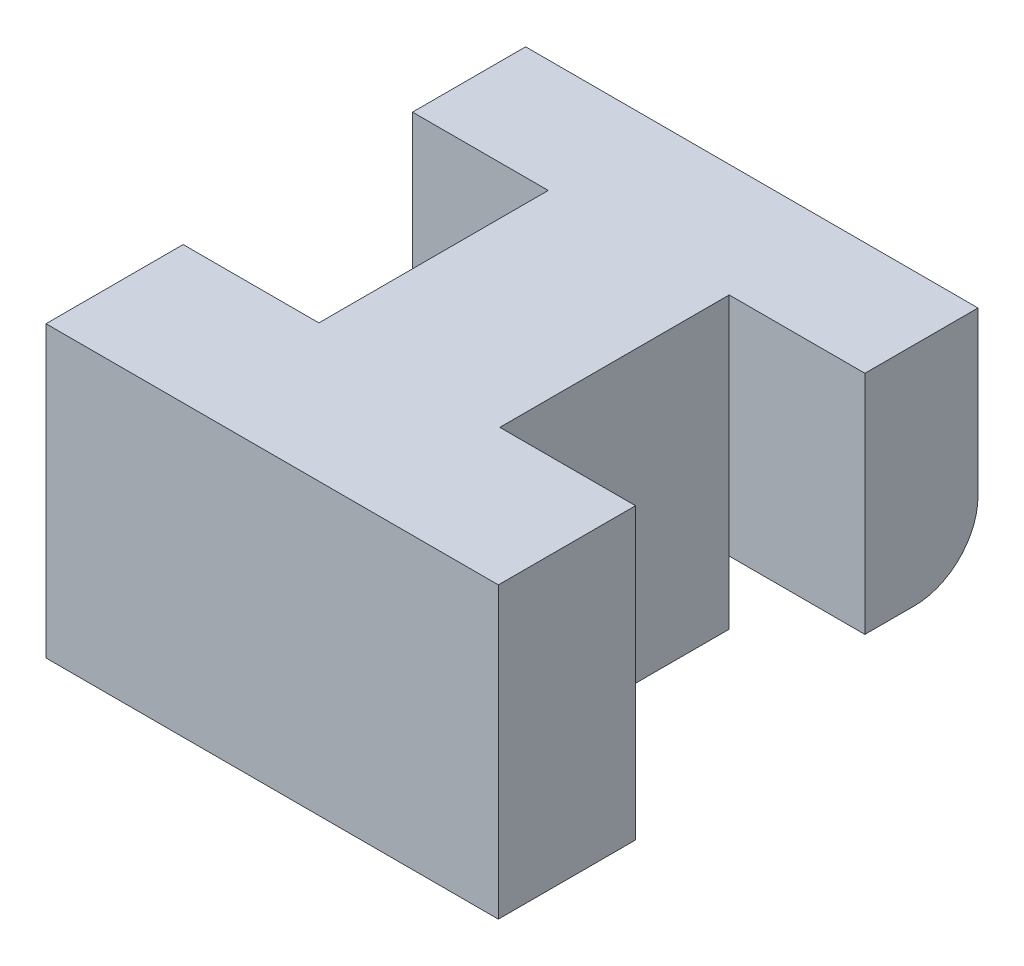
ISO-10303-21;
HEADER;
FILE_DESCRIPTION(('STEP AP214'),'2;1');
FILE_NAME('part.step','',(''),(''),'','','');
FILE_SCHEMA(('AUTOMOTIVE_DESIGN { 1 0 10303 214 1 1 1 1 }'));
ENDSEC;
DATA;
#1=APPLICATION_CONTEXT('core data for automotive mechanical design processes');
#2=APPLICATION_PROTOCOL_DEFINITION('international standard','automotive_design',2000,#1);
#3=PRODUCT_CONTEXT('',#1,'mechanical');
#4=PRODUCT('Part','Part','',(#3));
#5=PRODUCT_RELATED_PRODUCT_CATEGORY('part','',(#4));
#6=PRODUCT_DEFINITION_FORMATION('','',#4);
#7=PRODUCT_DEFINITION_CONTEXT('part definition',#1,'design');
#8=PRODUCT_DEFINITION('design','',#6,#7);
#9=PRODUCT_DEFINITION_SHAPE('','',#8);
#10=(LENGTH_UNIT() NAMED_UNIT(*) SI_UNIT(.MILLI.,.METRE.));
#11=(NAMED_UNIT(*) PLANE_ANGLE_UNIT() SI_UNIT($,.RADIAN.));
#12=(NAMED_UNIT(*) SI_UNIT($,.STERADIAN.) SOLID_ANGLE_UNIT());
#13=UNCERTAINTY_MEASURE_WITH_UNIT(LENGTH_MEASURE(1.E-05),#10,'distance_accuracy_value','');
#14=(GEOMETRIC_REPRESENTATION_CONTEXT(3) GLOBAL_UNCERTAINTY_ASSIGNED_CONTEXT((#13)) GLOBAL_UNIT_ASSIGNED_CONTEXT((#10,
#11,#12)) REPRESENTATION_CONTEXT('',''));
#15=CARTESIAN_POINT('',(0.,0.,0.));
#16=DIRECTION('',(0.,0.,1.));
#17=DIRECTION('',(1.,0.,0.));
#18=AXIS2_PLACEMENT_3D('',#15,#16,#17);
#19=CARTESIAN_POINT('',(-7.21018470428137,3.29148079006677,0.505779637135901));
#20=DIRECTION('',(0.,0.,1.));
#21=DIRECTION('',(1.,0.,0.));
#22=AXIS2_PLACEMENT_3D('',#19,#20,#21);
#23=PLANE('',#22);
#24=DIRECTION('',(0.,-1.,0.));
#25=VECTOR('',#24,1.);
#26=CARTESIAN_POINT('',(-19.357553125334,10.4914807900668,0.505779637135901));
#27=LINE('',#26,#25);
#28=CARTESIAN_POINT('',(-19.357553125334,10.4914807900668,0.505779637135901));
#29=VERTEX_POINT('',#28);
#30=CARTESIAN_POINT('',(-19.357553125334,5.49148079006676,0.505779637135904));
#31=VERTEX_POINT('',#30);
#32=EDGE_CURVE('E191',#29,#31,#27,.T.);
#33=ORIENTED_EDGE('',*,*,#32,.T.);
#34=DIRECTION('',(1.,0.,0.));
#35=VECTOR('',#34,1.);
#36=CARTESIAN_POINT('',(-31.0575531253339,5.49148079006676,0.505779637135904));
#37=LINE('',#36,#35);
#38=CARTESIAN_POINT('',(-16.357553125334,5.49148079006676,0.505779637135904));
#39=VERTEX_POINT('',#38);
#40=EDGE_CURVE('E173',#31,#39,#37,.T.);
#41=ORIENTED_EDGE('',*,*,#40,.T.);
#42=DIRECTION('',(0.,-1.,0.));
#43=VECTOR('',#42,1.);
#44=CARTESIAN_POINT('',(-16.357553125334,4.09148079006677,0.505779637135901));
#45=LINE('',#44,#43);
#46=CARTESIAN_POINT('',(-16.357553125334,10.4914807900668,0.505779637135901));
#47=VERTEX_POINT('',#46);
#48=EDGE_CURVE('E238',#47,#39,#45,.T.);
#49=ORIENTED_EDGE('',*,*,#48,.F.);
#50=DIRECTION('',(-1.,0.,0.));
#51=VECTOR('',#50,1.);
#52=CARTESIAN_POINT('',(-19.357553125334,10.4914807900668,0.505779637135901));
#53=LINE('',#52,#51);
#54=EDGE_CURVE('E198',#47,#29,#53,.T.);
#55=ORIENTED_EDGE('',*,*,#54,.T.);
#56=EDGE_LOOP('',(#33,#41,#49,#55));
#57=FACE_BOUND('',#56,.T.);
#58=ADVANCED_FACE('F45',(#57),#23,.T.);
#59=CARTESIAN_POINT('',(-9.35755312533401,10.4914807900668,0.505779637135901));
#60=DIRECTION('',(-1.,0.,0.));
#61=DIRECTION('',(0.,0.,1.));
#62=AXIS2_PLACEMENT_3D('',#59,#60,#61);
#63=PLANE('',#62);
#64=DIRECTION('',(0.,0.,1.));
#65=VECTOR('',#64,1.);
#66=CARTESIAN_POINT('',(-9.35755312533401,5.49148079006676,0.505779637135901));
#67=LINE('',#66,#65);
#68=CARTESIAN_POINT('',(-9.35755312533401,5.49148079006676,-0.594220362864106));
#69=VERTEX_POINT('',#68);
#70=CARTESIAN_POINT('',(-9.35755312533401,5.49148079006676,0.505779637135904));
#71=VERTEX_POINT('',#70);
#72=EDGE_CURVE('E194',#69,#71,#67,.T.);
#73=ORIENTED_EDGE('',*,*,#72,.F.);
#74=CARTESIAN_POINT('',(-9.35755312533401,6.89148079006676,-0.594220362864106));
#75=DIRECTION('',(-1.,0.,0.));
#76=DIRECTION('',(0.,0.,1.));
#77=AXIS2_PLACEMENT_3D('',#74,#75,#76);
#78=CIRCLE('',#77,1.4);
#79=CARTESIAN_POINT('',(-9.35755312533401,6.89148079006676,-1.9942203628641));
#80=VERTEX_POINT('',#79);
#81=EDGE_CURVE('E262',#80,#69,#78,.T.);
#82=ORIENTED_EDGE('',*,*,#81,.F.);
#83=DIRECTION('',(0.,-1.,0.));
#84=VECTOR('',#83,1.);
#85=CARTESIAN_POINT('',(-9.35755312533401,10.4914807900668,-1.9942203628641));
#86=LINE('',#85,#84);
#87=CARTESIAN_POINT('',(-9.35755312533401,10.4914807900668,-1.99422036286411));
#88=VERTEX_POINT('',#87);
#89=EDGE_CURVE('E254',#88,#80,#86,.T.);
#90=ORIENTED_EDGE('',*,*,#89,.F.);
#91=DIRECTION('',(0.,0.,-1.));
#92=VECTOR('',#91,1.);
#93=CARTESIAN_POINT('',(-9.35755312533401,10.4914807900668,0.505779637135901));
#94=LINE('',#93,#92);
#95=CARTESIAN_POINT('',(-9.35755312533401,10.4914807900668,0.505779637135901));
#96=VERTEX_POINT('',#95);
#97=EDGE_CURVE('E207',#96,#88,#94,.T.);
#98=ORIENTED_EDGE('',*,*,#97,.F.);
#99=DIRECTION('',(0.,1.,0.));
#100=VECTOR('',#99,1.);
#101=CARTESIAN_POINT('',(-9.35755312533401,10.4914807900668,0.505779637135901));
#102=LINE('',#101,#100);
#103=EDGE_CURVE('E220',#71,#96,#102,.T.);
#104=ORIENTED_EDGE('',*,*,#103,.F.);
#105=EDGE_LOOP('',(#73,#82,#90,#98,#104));
#106=FACE_BOUND('',#105,.T.);
#107=ADVANCED_FACE('F47',(#106),#63,.F.);
#108=CARTESIAN_POINT('',(-19.357553125334,10.4914807900668,0.505779637135901));
#109=DIRECTION('',(0.,-1.,0.));
#110=DIRECTION('',(0.,0.,-1.));
#111=AXIS2_PLACEMENT_3D('',#108,#109,#110);
#112=PLANE('',#111);
#113=DIRECTION('',(1.,0.,0.));
#114=VECTOR('',#113,1.);
#115=CARTESIAN_POINT('',(-19.357553125334,10.4914807900668,-1.99422036286411));
#116=LINE('',#115,#114);
#117=CARTESIAN_POINT('',(-19.357553125334,10.4914807900668,-1.99422036286411));
#118=VERTEX_POINT('',#117);
#119=EDGE_CURVE('E258',#118,#88,#116,.T.);
#120=ORIENTED_EDGE('',*,*,#119,.F.);
#121=DIRECTION('',(0.,0.,-1.));
#122=VECTOR('',#121,1.);
#123=CARTESIAN_POINT('',(-19.357553125334,10.4914807900668,0.505779637135901));
#124=LINE('',#123,#122);
#125=EDGE_CURVE('E201',#29,#118,#124,.T.);
#126=ORIENTED_EDGE('',*,*,#125,.F.);
#127=ORIENTED_EDGE('',*,*,#54,.F.);
#128=DIRECTION('',(0.,0.,-1.));
#129=VECTOR('',#128,1.);
#130=CARTESIAN_POINT('',(-16.357553125334,10.4914807900668,8.60828021340911));
#131=LINE('',#130,#129);
#132=CARTESIAN_POINT('',(-16.357553125334,10.4914807900668,5.57618139560247));
#133=VERTEX_POINT('',#132);
#134=EDGE_CURVE('E75',#133,#47,#131,.T.);
#135=ORIENTED_EDGE('',*,*,#134,.F.);
#136=DIRECTION('',(1.,0.,0.));
#137=VECTOR('',#136,1.);
#138=CARTESIAN_POINT('',(-26.4394754096396,10.4914807900668,5.57618139560247));
#139=LINE('',#138,#137);
#140=CARTESIAN_POINT('',(-19.357553125334,10.4914807900668,5.57618139560247));
#141=VERTEX_POINT('',#140);
#142=EDGE_CURVE('E275',#141,#133,#139,.T.);
#143=ORIENTED_EDGE('',*,*,#142,.F.);
#144=DIRECTION('',(0.,0.,-1.));
#145=VECTOR('',#144,1.);
#146=CARTESIAN_POINT('',(-19.357553125334,10.4914807900668,8.60828021340911));
#147=LINE('',#146,#145);
#148=CARTESIAN_POINT('',(-19.357553125334,10.4914807900668,8.60828021340911));
#149=VERTEX_POINT('',#148);
#150=EDGE_CURVE('E274',#149,#141,#147,.T.);
#151=ORIENTED_EDGE('',*,*,#150,.F.);
#152=DIRECTION('',(-1.,0.,0.));
#153=VECTOR('',#152,1.);
#154=CARTESIAN_POINT('',(-12.357553125334,10.4914807900668,8.60828021340911));
#155=LINE('',#154,#153);
#156=CARTESIAN_POINT('',(-9.35755312533401,10.4914807900668,8.60828021340911));
#157=VERTEX_POINT('',#156);
#158=EDGE_CURVE('E320',#157,#149,#155,.T.);
#159=ORIENTED_EDGE('',*,*,#158,.F.);
#160=DIRECTION('',(0.,0.,-1.));
#161=VECTOR('',#160,1.);
#162=CARTESIAN_POINT('',(-9.35755312533401,10.4914807900668,8.60828021340911));
#163=LINE('',#162,#161);
#164=CARTESIAN_POINT('',(-9.35755312533401,10.4914807900668,5.57618139560247));
#165=VERTEX_POINT('',#164);
#166=EDGE_CURVE('E299',#157,#165,#163,.T.);
#167=ORIENTED_EDGE('',*,*,#166,.T.);
#168=DIRECTION('',(-1.,0.,0.));
#169=VECTOR('',#168,1.);
#170=CARTESIAN_POINT('',(-2.2756308410284,10.4914807900668,5.57618139560247));
#171=LINE('',#170,#169);
#172=CARTESIAN_POINT('',(-12.357553125334,10.4914807900668,5.57618139560247));
#173=VERTEX_POINT('',#172);
#174=EDGE_CURVE('E310',#165,#173,#171,.T.);
#175=ORIENTED_EDGE('',*,*,#174,.T.);
#176=DIRECTION('',(0.,0.,-1.));
#177=VECTOR('',#176,1.);
#178=CARTESIAN_POINT('',(-12.357553125334,10.4914807900668,8.60828021340911));
#179=LINE('',#178,#177);
#180=CARTESIAN_POINT('',(-12.357553125334,10.4914807900668,0.505779637135901));
#181=VERTEX_POINT('',#180);
#182=EDGE_CURVE('E323',#173,#181,#179,.T.);
#183=ORIENTED_EDGE('',*,*,#182,.T.);
#184=EDGE_CURVE('E202',#96,#181,#53,.T.);
#185=ORIENTED_EDGE('',*,*,#184,.F.);
#186=ORIENTED_EDGE('',*,*,#97,.T.);
#187=EDGE_LOOP('',(#120,#126,#127,#135,#143,#151,#159,#167,#175,#183,#185,#186));
#188=FACE_BOUND('',#187,.T.);
#189=ADVANCED_FACE('F257',(#188),#112,.F.);
#190=CARTESIAN_POINT('',(-19.357553125334,10.4914807900668,0.505779637135901));
#191=DIRECTION('',(1.,0.,0.));
#192=DIRECTION('',(0.,0.,-1.));
#193=AXIS2_PLACEMENT_3D('',#190,#191,#192);
#194=PLANE('',#193);
#195=DIRECTION('',(0.,0.,-1.));
#196=VECTOR('',#195,1.);
#197=CARTESIAN_POINT('',(-19.357553125334,5.49148079006676,0.505779637135901));
#198=LINE('',#197,#196);
#199=CARTESIAN_POINT('',(-19.357553125334,5.49148079006676,-0.59422036286411));
#200=VERTEX_POINT('',#199);
#201=EDGE_CURVE('E177',#31,#200,#198,.T.);
#202=ORIENTED_EDGE('',*,*,#201,.F.);
#203=ORIENTED_EDGE('',*,*,#32,.F.);
#204=ORIENTED_EDGE('',*,*,#125,.T.);
#205=DIRECTION('',(0.,1.,0.));
#206=VECTOR('',#205,1.);
#207=CARTESIAN_POINT('',(-19.357553125334,10.4914807900668,-1.99422036286411));
#208=LINE('',#207,#206);
#209=CARTESIAN_POINT('',(-19.357553125334,6.89148079006676,-1.99422036286411));
#210=VERTEX_POINT('',#209);
#211=EDGE_CURVE('E11',#210,#118,#208,.T.);
#212=ORIENTED_EDGE('',*,*,#211,.F.);
#213=CARTESIAN_POINT('',(-19.357553125334,6.89148079006676,-0.59422036286411));
#214=DIRECTION('',(1.,0.,0.));
#215=DIRECTION('',(0.,0.,-1.));
#216=AXIS2_PLACEMENT_3D('',#213,#214,#215);
#217=CIRCLE('',#216,1.4);
#218=EDGE_CURVE('E54',#200,#210,#217,.T.);
#219=ORIENTED_EDGE('',*,*,#218,.F.);
#220=EDGE_LOOP('',(#202,#203,#204,#212,#219));
#221=FACE_BOUND('',#220,.T.);
#222=ADVANCED_FACE('F189',(#221),#194,.F.);
#223=DIRECTION('',(0.,1.,0.));
#224=VECTOR('',#223,1.);
#225=CARTESIAN_POINT('',(-12.357553125334,4.09148079006677,0.505779637135901));
#226=LINE('',#225,#224);
#227=CARTESIAN_POINT('',(-12.357553125334,5.49148079006676,0.505779637135904));
#228=VERTEX_POINT('',#227);
#229=EDGE_CURVE('E227',#228,#181,#226,.T.);
#230=ORIENTED_EDGE('',*,*,#229,.F.);
#231=EDGE_CURVE('E185',#228,#71,#37,.T.);
#232=ORIENTED_EDGE('',*,*,#231,.T.);
#233=ORIENTED_EDGE('',*,*,#103,.T.);
#234=ORIENTED_EDGE('',*,*,#184,.T.);
#235=EDGE_LOOP('',(#230,#232,#233,#234));
#236=FACE_BOUND('',#235,.T.);
#237=ADVANCED_FACE('F352',(#236),#23,.T.);
#238=CARTESIAN_POINT('',(-12.357553125334,4.09148079006677,8.60828021340911));
#239=DIRECTION('',(-1.,0.,0.));
#240=DIRECTION('',(0.,-1.,0.));
#241=AXIS2_PLACEMENT_3D('',#238,#239,#240);
#242=PLANE('',#241);
#243=DIRECTION('',(0.,1.,0.));
#244=VECTOR('',#243,1.);
#245=CARTESIAN_POINT('',(-12.357553125334,10.4914807900668,5.57618139560247));
#246=LINE('',#245,#244);
#247=CARTESIAN_POINT('',(-12.357553125334,4.09148079006677,5.57618139560247));
#248=VERTEX_POINT('',#247);
#249=EDGE_CURVE('E293',#248,#173,#246,.T.);
#250=ORIENTED_EDGE('',*,*,#249,.F.);
#251=DIRECTION('',(0.,0.,-1.));
#252=VECTOR('',#251,1.);
#253=CARTESIAN_POINT('',(-12.357553125334,4.09148079006677,8.60828021340911));
#254=LINE('',#253,#252);
#255=CARTESIAN_POINT('',(-12.357553125334,4.09148079006676,0.505779637135904));
#256=VERTEX_POINT('',#255);
#257=EDGE_CURVE('E326',#248,#256,#254,.T.);
#258=ORIENTED_EDGE('',*,*,#257,.T.);
#259=EDGE_CURVE('E221',#256,#228,#226,.T.);
#260=ORIENTED_EDGE('',*,*,#259,.T.);
#261=ORIENTED_EDGE('',*,*,#229,.T.);
#262=ORIENTED_EDGE('',*,*,#182,.F.);
#263=EDGE_LOOP('',(#250,#258,#260,#261,#262));
#264=FACE_BOUND('',#263,.T.);
#265=ADVANCED_FACE('F366',(#264),#242,.F.);
#266=CARTESIAN_POINT('',(-19.357553125334,4.09148079006677,0.505779637135901));
#267=DIRECTION('',(0.,1.,0.));
#268=DIRECTION('',(-1.,0.,0.));
#269=AXIS2_PLACEMENT_3D('',#266,#267,#268);
#270=PLANE('',#269);
#271=DIRECTION('',(0.,0.,-1.));
#272=VECTOR('',#271,1.);
#273=CARTESIAN_POINT('',(-16.357553125334,4.09148079006677,8.60828021340911));
#274=LINE('',#273,#272);
#275=CARTESIAN_POINT('',(-16.357553125334,4.09148079006677,5.57618139560247));
#276=VERTEX_POINT('',#275);
#277=CARTESIAN_POINT('',(-16.357553125334,4.09148079006677,0.505779637135901));
#278=VERTEX_POINT('',#277);
#279=EDGE_CURVE('E330',#276,#278,#274,.T.);
#280=ORIENTED_EDGE('',*,*,#279,.T.);
#281=DIRECTION('',(1.,0.,0.));
#282=VECTOR('',#281,1.);
#283=CARTESIAN_POINT('',(-31.0575531253339,4.09148079006676,0.505779637135904));
#284=LINE('',#283,#282);
#285=EDGE_CURVE('E64',#278,#256,#284,.T.);
#286=ORIENTED_EDGE('',*,*,#285,.T.);
#287=ORIENTED_EDGE('',*,*,#257,.F.);
#288=DIRECTION('',(-1.,0.,0.));
#289=VECTOR('',#288,1.);
#290=CARTESIAN_POINT('',(-2.2756308410284,4.09148079006677,5.57618139560247));
#291=LINE('',#290,#289);
#292=CARTESIAN_POINT('',(-9.35755312533401,4.09148079006677,5.57618139560247));
#293=VERTEX_POINT('',#292);
#294=EDGE_CURVE('E313',#293,#248,#291,.T.);
#295=ORIENTED_EDGE('',*,*,#294,.F.);
#296=DIRECTION('',(0.,0.,1.));
#297=VECTOR('',#296,1.);
#298=CARTESIAN_POINT('',(-9.35755312533401,4.09148079006677,8.60828021340912));
#299=LINE('',#298,#297);
#300=CARTESIAN_POINT('',(-9.35755312533401,4.09148079006677,8.60828021340912));
#301=VERTEX_POINT('',#300);
#302=EDGE_CURVE('E298',#293,#301,#299,.T.);
#303=ORIENTED_EDGE('',*,*,#302,.T.);
#304=DIRECTION('',(1.,0.,0.));
#305=VECTOR('',#304,1.);
#306=CARTESIAN_POINT('',(-12.357553125334,4.09148079006677,8.60828021340911));
#307=LINE('',#306,#305);
#308=CARTESIAN_POINT('',(-19.357553125334,4.09148079006677,8.60828021340912));
#309=VERTEX_POINT('',#308);
#310=EDGE_CURVE('E226',#309,#301,#307,.T.);
#311=ORIENTED_EDGE('',*,*,#310,.F.);
#312=DIRECTION('',(0.,0.,1.));
#313=VECTOR('',#312,1.);
#314=CARTESIAN_POINT('',(-19.357553125334,4.09148079006677,8.60828021340911));
#315=LINE('',#314,#313);
#316=CARTESIAN_POINT('',(-19.357553125334,4.09148079006677,5.57618139560247));
#317=VERTEX_POINT('',#316);
#318=EDGE_CURVE('E282',#317,#309,#315,.T.);
#319=ORIENTED_EDGE('',*,*,#318,.F.);
#320=DIRECTION('',(1.,0.,0.));
#321=VECTOR('',#320,1.);
#322=CARTESIAN_POINT('',(-26.4394754096396,4.09148079006677,5.57618139560247));
#323=LINE('',#322,#321);
#324=EDGE_CURVE('E285',#317,#276,#323,.T.);
#325=ORIENTED_EDGE('',*,*,#324,.T.);
#326=EDGE_LOOP('',(#280,#286,#287,#295,#303,#311,#319,#325));
#327=FACE_BOUND('',#326,.T.);
#328=ADVANCED_FACE('F368',(#327),#270,.F.);
#329=CARTESIAN_POINT('',(-16.357553125334,4.09148079006677,8.60828021340911));
#330=DIRECTION('',(1.,0.,0.));
#331=DIRECTION('',(0.,0.,-1.));
#332=AXIS2_PLACEMENT_3D('',#329,#330,#331);
#333=PLANE('',#332);
#334=ORIENTED_EDGE('',*,*,#279,.F.);
#335=DIRECTION('',(0.,1.,0.));
#336=VECTOR('',#335,1.);
#337=CARTESIAN_POINT('',(-16.357553125334,4.09148079006677,5.57618139560247));
#338=LINE('',#337,#336);
#339=EDGE_CURVE('E265',#276,#133,#338,.T.);
#340=ORIENTED_EDGE('',*,*,#339,.T.);
#341=ORIENTED_EDGE('',*,*,#134,.T.);
#342=ORIENTED_EDGE('',*,*,#48,.T.);
#343=EDGE_CURVE('E239',#39,#278,#45,.T.);
#344=ORIENTED_EDGE('',*,*,#343,.T.);
#345=EDGE_LOOP('',(#334,#340,#341,#342,#344));
#346=FACE_BOUND('',#345,.T.);
#347=ADVANCED_FACE('F374',(#346),#333,.F.);
#348=CARTESIAN_POINT('',(-7.21018470428137,3.29148079006677,8.60828021340911));
#349=DIRECTION('',(0.,0.,1.));
#350=DIRECTION('',(1.,0.,0.));
#351=AXIS2_PLACEMENT_3D('',#348,#349,#350);
#352=PLANE('',#351);
#353=ORIENTED_EDGE('',*,*,#158,.T.);
#354=DIRECTION('',(0.,1.,0.));
#355=VECTOR('',#354,1.);
#356=CARTESIAN_POINT('',(-19.357553125334,4.09148079006677,8.60828021340912));
#357=LINE('',#356,#355);
#358=EDGE_CURVE('E278',#309,#149,#357,.T.);
#359=ORIENTED_EDGE('',*,*,#358,.F.);
#360=ORIENTED_EDGE('',*,*,#310,.T.);
#361=DIRECTION('',(0.,1.,0.));
#362=VECTOR('',#361,1.);
#363=CARTESIAN_POINT('',(-9.35755312533401,10.4914807900668,8.60828021340911));
#364=LINE('',#363,#362);
#365=EDGE_CURVE('E303',#301,#157,#364,.T.);
#366=ORIENTED_EDGE('',*,*,#365,.T.);
#367=EDGE_LOOP('',(#353,#359,#360,#366));
#368=FACE_BOUND('',#367,.T.);
#369=ADVANCED_FACE('F454',(#368),#352,.T.);
#370=CARTESIAN_POINT('',(-2.2756308410284,10.4914807900668,5.57618139560247));
#371=DIRECTION('',(0.,0.,1.));
#372=DIRECTION('',(1.,0.,0.));
#373=AXIS2_PLACEMENT_3D('',#370,#371,#372);
#374=PLANE('',#373);
#375=ORIENTED_EDGE('',*,*,#174,.F.);
#376=DIRECTION('',(0.,-1.,0.));
#377=VECTOR('',#376,1.);
#378=CARTESIAN_POINT('',(-9.35755312533401,10.4914807900668,5.57618139560247));
#379=LINE('',#378,#377);
#380=EDGE_CURVE('E294',#165,#293,#379,.T.);
#381=ORIENTED_EDGE('',*,*,#380,.T.);
#382=ORIENTED_EDGE('',*,*,#294,.T.);
#383=ORIENTED_EDGE('',*,*,#249,.T.);
#384=EDGE_LOOP('',(#375,#381,#382,#383));
#385=FACE_BOUND('',#384,.T.);
#386=ADVANCED_FACE('F403',(#385),#374,.F.);
#387=CARTESIAN_POINT('',(-9.35755312533401,10.4914807900668,0.505779637135901));
#388=DIRECTION('',(-1.,0.,0.));
#389=DIRECTION('',(0.,0.,1.));
#390=AXIS2_PLACEMENT_3D('',#387,#388,#389);
#391=PLANE('',#390);
#392=ORIENTED_EDGE('',*,*,#302,.F.);
#393=ORIENTED_EDGE('',*,*,#380,.F.);
#394=ORIENTED_EDGE('',*,*,#166,.F.);
#395=ORIENTED_EDGE('',*,*,#365,.F.);
#396=EDGE_LOOP('',(#392,#393,#394,#395));
#397=FACE_BOUND('',#396,.T.);
#398=ADVANCED_FACE('F449',(#397),#391,.F.);
#399=CARTESIAN_POINT('',(-26.4394754096396,4.09148079006677,5.57618139560247));
#400=DIRECTION('',(0.,0.,-1.));
#401=DIRECTION('',(-1.,0.,0.));
#402=AXIS2_PLACEMENT_3D('',#399,#400,#401);
#403=PLANE('',#402);
#404=DIRECTION('',(0.,-1.,0.));
#405=VECTOR('',#404,1.);
#406=CARTESIAN_POINT('',(-19.357553125334,4.09148079006677,5.57618139560247));
#407=LINE('',#406,#405);
#408=EDGE_CURVE('E271',#141,#317,#407,.T.);
#409=ORIENTED_EDGE('',*,*,#408,.F.);
#410=ORIENTED_EDGE('',*,*,#142,.T.);
#411=ORIENTED_EDGE('',*,*,#339,.F.);
#412=ORIENTED_EDGE('',*,*,#324,.F.);
#413=EDGE_LOOP('',(#409,#410,#411,#412));
#414=FACE_BOUND('',#413,.T.);
#415=ADVANCED_FACE('F438',(#414),#403,.T.);
#416=CARTESIAN_POINT('',(-19.357553125334,10.4914807900668,0.505779637135901));
#417=DIRECTION('',(1.,0.,0.));
#418=DIRECTION('',(0.,0.,-1.));
#419=AXIS2_PLACEMENT_3D('',#416,#417,#418);
#420=PLANE('',#419);
#421=ORIENTED_EDGE('',*,*,#358,.T.);
#422=ORIENTED_EDGE('',*,*,#150,.T.);
#423=ORIENTED_EDGE('',*,*,#408,.T.);
#424=ORIENTED_EDGE('',*,*,#318,.T.);
#425=EDGE_LOOP('',(#421,#422,#423,#424));
#426=FACE_BOUND('',#425,.T.);
#427=ADVANCED_FACE('F432',(#426),#420,.F.);
#428=CARTESIAN_POINT('',(2.24244687466593,15.4914807900668,-1.9942203628641));
#429=DIRECTION('',(0.,0.,-1.));
#430=DIRECTION('',(-1.,0.,0.));
#431=AXIS2_PLACEMENT_3D('',#428,#429,#430);
#432=PLANE('',#431);
#433=ORIENTED_EDGE('',*,*,#89,.T.);
#434=DIRECTION('',(1.,0.,0.));
#435=VECTOR('',#434,1.);
#436=CARTESIAN_POINT('',(2.24244687466593,6.89148079006676,-1.9942203628641));
#437=LINE('',#436,#435);
#438=EDGE_CURVE('E195',#210,#80,#437,.T.);
#439=ORIENTED_EDGE('',*,*,#438,.F.);
#440=ORIENTED_EDGE('',*,*,#211,.T.);
#441=ORIENTED_EDGE('',*,*,#119,.T.);
#442=EDGE_LOOP('',(#433,#439,#440,#441));
#443=FACE_BOUND('',#442,.T.);
#444=ADVANCED_FACE('F251',(#443),#432,.T.);
#445=CARTESIAN_POINT('',(2.24244687466593,6.89148079006676,-0.594220362864106));
#446=DIRECTION('',(-1.,0.,0.));
#447=DIRECTION('',(0.,0.,1.));
#448=AXIS2_PLACEMENT_3D('',#445,#446,#447);
#449=CYLINDRICAL_SURFACE('',#448,1.4);
#450=ORIENTED_EDGE('',*,*,#81,.T.);
#451=DIRECTION('',(1.,0.,0.));
#452=VECTOR('',#451,1.);
#453=CARTESIAN_POINT('',(-31.0575531253339,5.49148079006676,-0.59422036286411));
#454=LINE('',#453,#452);
#455=EDGE_CURVE('E249',#69,#200,#454,.F.);
#456=ORIENTED_EDGE('',*,*,#455,.T.);
#457=ORIENTED_EDGE('',*,*,#218,.T.);
#458=ORIENTED_EDGE('',*,*,#438,.T.);
#459=EDGE_LOOP('',(#450,#456,#457,#458));
#460=FACE_BOUND('',#459,.T.);
#461=ADVANCED_FACE('F247',(#460),#449,.T.);
#462=CARTESIAN_POINT('',(2.24244687466599,5.49148079006676,-43.2942203628641));
#463=DIRECTION('',(0.,-1.,0.));
#464=DIRECTION('',(0.,0.,-1.));
#465=AXIS2_PLACEMENT_3D('',#462,#463,#464);
#466=PLANE('',#465);
#467=ORIENTED_EDGE('',*,*,#72,.T.);
#468=ORIENTED_EDGE('',*,*,#231,.F.);
#469=EDGE_CURVE('E180',#39,#228,#37,.T.);
#470=ORIENTED_EDGE('',*,*,#469,.F.);
#471=ORIENTED_EDGE('',*,*,#40,.F.);
#472=ORIENTED_EDGE('',*,*,#201,.T.);
#473=ORIENTED_EDGE('',*,*,#455,.F.);
#474=EDGE_LOOP('',(#467,#468,#470,#471,#472,#473));
#475=FACE_BOUND('',#474,.T.);
#476=ADVANCED_FACE('F175',(#475),#466,.T.);
#477=CARTESIAN_POINT('',(-31.0575531253339,4.09148079006676,0.505779637135904));
#478=DIRECTION('',(0.,0.,1.));
#479=DIRECTION('',(1.,0.,0.));
#480=AXIS2_PLACEMENT_3D('',#477,#478,#479);
#481=PLANE('',#480);
#482=ORIENTED_EDGE('',*,*,#285,.F.);
#483=ORIENTED_EDGE('',*,*,#343,.F.);
#484=ORIENTED_EDGE('',*,*,#469,.T.);
#485=ORIENTED_EDGE('',*,*,#259,.F.);
#486=EDGE_LOOP('',(#482,#483,#484,#485));
#487=FACE_BOUND('',#486,.T.);
#488=ADVANCED_FACE('F365',(#487),#481,.F.);
#489=CLOSED_SHELL('',(#58,#107,#189,#222,#237,#265,#328,#347,#369,#386,#398,#415,#427,#444,#461,
#476,#488));
#490=MANIFOLD_SOLID_BREP('B2',#489);
#491=ADVANCED_BREP_SHAPE_REPRESENTATION('',(#18,#490),#14);
#492=SHAPE_DEFINITION_REPRESENTATION(#9,#491);
ENDSEC;
END-ISO-10303-21;
